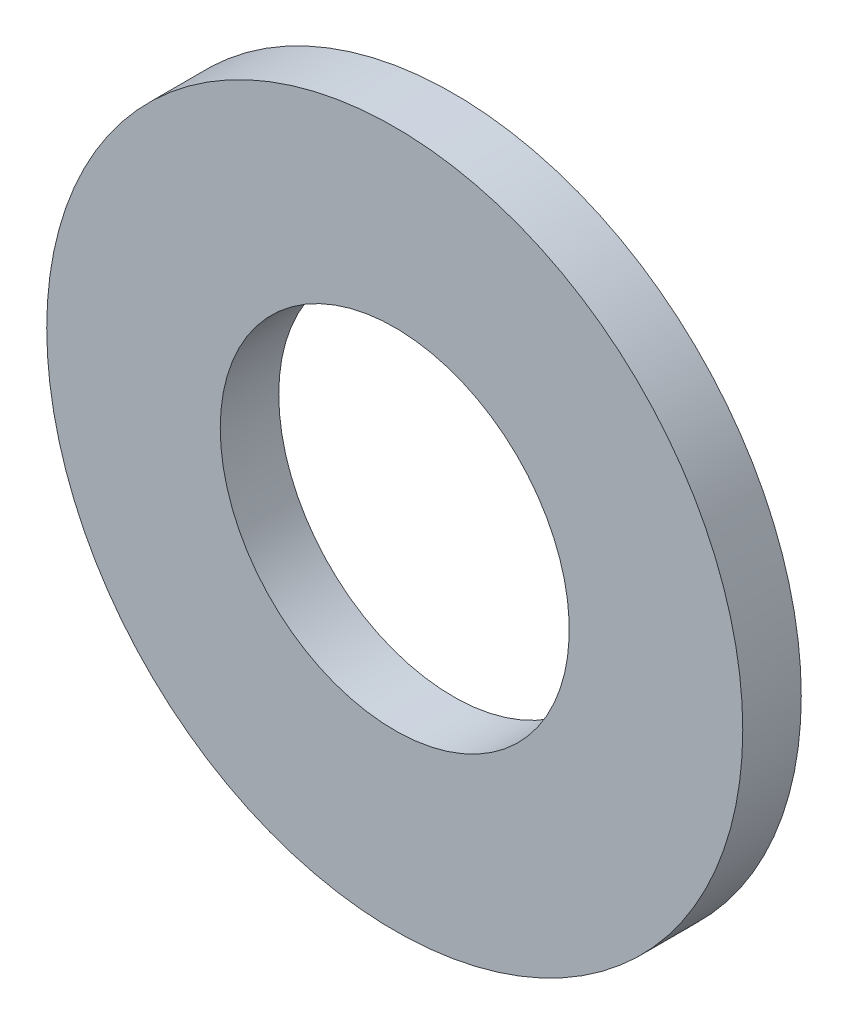
ISO-10303-21;
HEADER;
FILE_DESCRIPTION(('STEP AP214'),'2;1');
FILE_NAME('part.step','',(''),(''),'','','');
FILE_SCHEMA(('AUTOMOTIVE_DESIGN { 1 0 10303 214 1 1 1 1 }'));
ENDSEC;
DATA;
#1=APPLICATION_CONTEXT('core data for automotive mechanical design processes');
#2=APPLICATION_PROTOCOL_DEFINITION('international standard','automotive_design',2000,#1);
#3=PRODUCT_CONTEXT('',#1,'mechanical');
#4=PRODUCT('Part','Part','',(#3));
#5=PRODUCT_RELATED_PRODUCT_CATEGORY('part','',(#4));
#6=PRODUCT_DEFINITION_FORMATION('','',#4);
#7=PRODUCT_DEFINITION_CONTEXT('part definition',#1,'design');
#8=PRODUCT_DEFINITION('design','',#6,#7);
#9=PRODUCT_DEFINITION_SHAPE('','',#8);
#10=(LENGTH_UNIT() NAMED_UNIT(*) SI_UNIT(.MILLI.,.METRE.));
#11=(NAMED_UNIT(*) PLANE_ANGLE_UNIT() SI_UNIT($,.RADIAN.));
#12=(NAMED_UNIT(*) SI_UNIT($,.STERADIAN.) SOLID_ANGLE_UNIT());
#13=UNCERTAINTY_MEASURE_WITH_UNIT(LENGTH_MEASURE(1.E-05),#10,'distance_accuracy_value','');
#14=(GEOMETRIC_REPRESENTATION_CONTEXT(3) GLOBAL_UNCERTAINTY_ASSIGNED_CONTEXT((#13)) GLOBAL_UNIT_ASSIGNED_CONTEXT((#10,
#11,#12)) REPRESENTATION_CONTEXT('',''));
#15=CARTESIAN_POINT('',(0.,0.,0.));
#16=DIRECTION('',(0.,0.,1.));
#17=DIRECTION('',(1.,0.,0.));
#18=AXIS2_PLACEMENT_3D('',#15,#16,#17);
#19=CARTESIAN_POINT('',(0.,0.,0.));
#20=DIRECTION('',(0.,0.,-1.));
#21=DIRECTION('',(-1.,0.,0.));
#22=AXIS2_PLACEMENT_3D('',#19,#20,#21);
#23=PLANE('',#22);
#24=CARTESIAN_POINT('',(0.,0.,0.));
#25=DIRECTION('',(0.,0.,-1.));
#26=DIRECTION('',(-1.,0.,0.));
#27=AXIS2_PLACEMENT_3D('',#24,#25,#26);
#28=CIRCLE('',#27,8.763);
#29=CARTESIAN_POINT('',(-8.763,0.,0.));
#30=VERTEX_POINT('',#29);
#31=EDGE_CURVE('E24',#30,#30,#28,.F.);
#32=ORIENTED_EDGE('',*,*,#31,.F.);
#33=EDGE_LOOP('',(#32));
#34=FACE_BOUND('',#33,.T.);
#35=CARTESIAN_POINT('',(0.,0.,0.));
#36=DIRECTION('',(0.,0.,-1.));
#37=DIRECTION('',(-1.,0.,0.));
#38=AXIS2_PLACEMENT_3D('',#35,#36,#37);
#39=CIRCLE('',#38,4.3942);
#40=CARTESIAN_POINT('',(-4.3942,0.,0.));
#41=VERTEX_POINT('',#40);
#42=EDGE_CURVE('E15',#41,#41,#39,.F.);
#43=ORIENTED_EDGE('',*,*,#42,.T.);
#44=EDGE_LOOP('',(#43));
#45=FACE_BOUND('',#44,.T.);
#46=ADVANCED_FACE('F12',(#34,#45),#23,.T.);
#47=CARTESIAN_POINT('',(0.,0.,1.4732));
#48=DIRECTION('',(0.,0.,-1.));
#49=DIRECTION('',(-1.,0.,0.));
#50=AXIS2_PLACEMENT_3D('',#47,#48,#49);
#51=CYLINDRICAL_SURFACE('',#50,4.3942);
#52=CARTESIAN_POINT('',(0.,0.,1.4732));
#53=DIRECTION('',(0.,0.,-1.));
#54=DIRECTION('',(-1.,0.,0.));
#55=AXIS2_PLACEMENT_3D('',#52,#53,#54);
#56=CIRCLE('',#55,4.3942);
#57=CARTESIAN_POINT('',(-4.3942,0.,1.4732));
#58=VERTEX_POINT('',#57);
#59=EDGE_CURVE('E19',#58,#58,#56,.F.);
#60=ORIENTED_EDGE('',*,*,#59,.T.);
#61=EDGE_LOOP('',(#60));
#62=FACE_BOUND('',#61,.T.);
#63=ORIENTED_EDGE('',*,*,#42,.F.);
#64=EDGE_LOOP('',(#63));
#65=FACE_BOUND('',#64,.T.);
#66=ADVANCED_FACE('F33',(#62,#65),#51,.F.);
#67=CARTESIAN_POINT('',(0.,0.,1.4732));
#68=DIRECTION('',(0.,0.,-1.));
#69=DIRECTION('',(-1.,0.,0.));
#70=AXIS2_PLACEMENT_3D('',#67,#68,#69);
#71=CYLINDRICAL_SURFACE('',#70,8.763);
#72=ORIENTED_EDGE('',*,*,#31,.T.);
#73=EDGE_LOOP('',(#72));
#74=FACE_BOUND('',#73,.T.);
#75=CARTESIAN_POINT('',(0.,0.,1.4732));
#76=DIRECTION('',(0.,0.,-1.));
#77=DIRECTION('',(-1.,0.,0.));
#78=AXIS2_PLACEMENT_3D('',#75,#76,#77);
#79=CIRCLE('',#78,8.763);
#80=CARTESIAN_POINT('',(-8.763,0.,1.4732));
#81=VERTEX_POINT('',#80);
#82=EDGE_CURVE('E8',#81,#81,#79,.T.);
#83=ORIENTED_EDGE('',*,*,#82,.T.);
#84=EDGE_LOOP('',(#83));
#85=FACE_BOUND('',#84,.T.);
#86=ADVANCED_FACE('F35',(#74,#85),#71,.T.);
#87=CARTESIAN_POINT('',(0.,0.,1.4732));
#88=DIRECTION('',(0.,0.,-1.));
#89=DIRECTION('',(-1.,0.,0.));
#90=AXIS2_PLACEMENT_3D('',#87,#88,#89);
#91=PLANE('',#90);
#92=ORIENTED_EDGE('',*,*,#82,.F.);
#93=EDGE_LOOP('',(#92));
#94=FACE_BOUND('',#93,.T.);
#95=ORIENTED_EDGE('',*,*,#59,.F.);
#96=EDGE_LOOP('',(#95));
#97=FACE_BOUND('',#96,.T.);
#98=ADVANCED_FACE('F42',(#94,#97),#91,.F.);
#99=CLOSED_SHELL('',(#46,#66,#86,#98));
#100=MANIFOLD_SOLID_BREP('B1',#99);
#101=ADVANCED_BREP_SHAPE_REPRESENTATION('',(#18,#100),#14);
#102=SHAPE_DEFINITION_REPRESENTATION(#9,#101);
ENDSEC;
END-ISO-10303-21;
